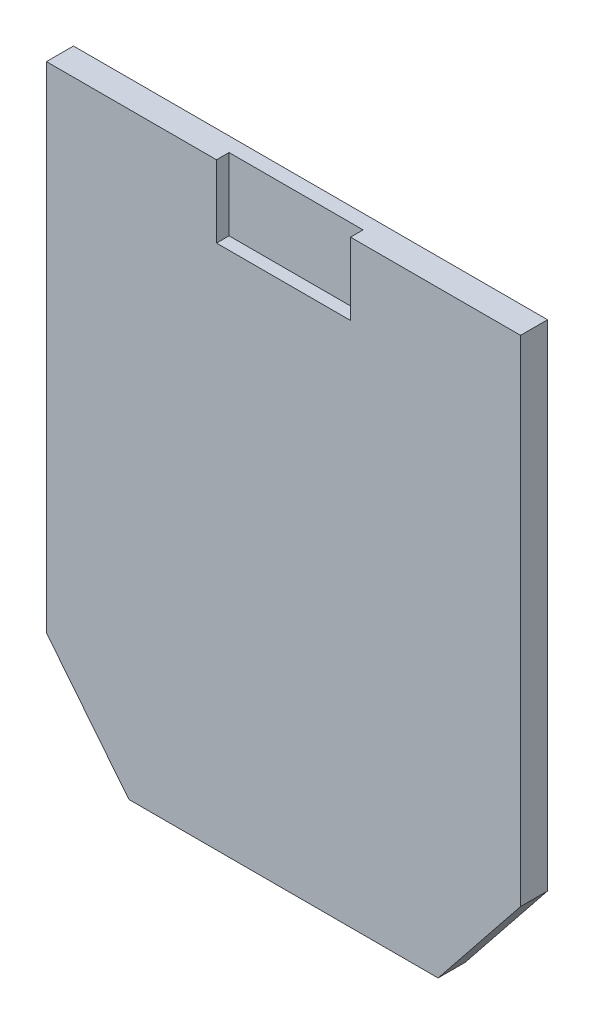
ISO-10303-21;
HEADER;
FILE_DESCRIPTION(('STEP AP214'),'2;1');
FILE_NAME('part.step','',(''),(''),'','','');
FILE_SCHEMA(('AUTOMOTIVE_DESIGN { 1 0 10303 214 1 1 1 1 }'));
ENDSEC;
DATA;
#1=APPLICATION_CONTEXT('core data for automotive mechanical design processes');
#2=APPLICATION_PROTOCOL_DEFINITION('international standard','automotive_design',2000,#1);
#3=PRODUCT_CONTEXT('',#1,'mechanical');
#4=PRODUCT('Part','Part','',(#3));
#5=PRODUCT_RELATED_PRODUCT_CATEGORY('part','',(#4));
#6=PRODUCT_DEFINITION_FORMATION('','',#4);
#7=PRODUCT_DEFINITION_CONTEXT('part definition',#1,'design');
#8=PRODUCT_DEFINITION('design','',#6,#7);
#9=PRODUCT_DEFINITION_SHAPE('','',#8);
#10=(LENGTH_UNIT() NAMED_UNIT(*) SI_UNIT(.MILLI.,.METRE.));
#11=(NAMED_UNIT(*) PLANE_ANGLE_UNIT() SI_UNIT($,.RADIAN.));
#12=(NAMED_UNIT(*) SI_UNIT($,.STERADIAN.) SOLID_ANGLE_UNIT());
#13=UNCERTAINTY_MEASURE_WITH_UNIT(LENGTH_MEASURE(1.E-05),#10,'distance_accuracy_value','');
#14=(GEOMETRIC_REPRESENTATION_CONTEXT(3) GLOBAL_UNCERTAINTY_ASSIGNED_CONTEXT((#13)) GLOBAL_UNIT_ASSIGNED_CONTEXT((#10,
#11,#12)) REPRESENTATION_CONTEXT('',''));
#15=CARTESIAN_POINT('',(0.,0.,0.));
#16=DIRECTION('',(0.,0.,1.));
#17=DIRECTION('',(1.,0.,0.));
#18=AXIS2_PLACEMENT_3D('',#15,#16,#17);
#19=CARTESIAN_POINT('',(-32.499999999986,120.,12.0000000000759));
#20=DIRECTION('',(-1.,0.,2.33402706883989E-12));
#21=DIRECTION('',(2.33402706883989E-12,0.,1.));
#22=AXIS2_PLACEMENT_3D('',#19,#20,#21);
#23=PLANE('',#22);
#24=DIRECTION('',(0.,-1.,0.));
#25=VECTOR('',#24,1.);
#26=CARTESIAN_POINT('',(-32.5000000000003,120.,5.90000000007587));
#27=LINE('',#26,#25);
#28=CARTESIAN_POINT('',(-32.5000000000003,120.,5.90000000007587));
#29=VERTEX_POINT('',#28);
#30=CARTESIAN_POINT('',(-32.5000000000003,85.,5.90000000007587));
#31=VERTEX_POINT('',#30);
#32=EDGE_CURVE('E60',#29,#31,#27,.T.);
#33=ORIENTED_EDGE('',*,*,#32,.F.);
#34=DIRECTION('',(-2.33402706883989E-12,0.,-1.));
#35=VECTOR('',#34,1.);
#36=CARTESIAN_POINT('',(-32.499999999986,120.,12.0000000000759));
#37=LINE('',#36,#35);
#38=CARTESIAN_POINT('',(-32.499999999986,120.,12.0000000000759));
#39=VERTEX_POINT('',#38);
#40=EDGE_CURVE('E133',#39,#29,#37,.T.);
#41=ORIENTED_EDGE('',*,*,#40,.F.);
#42=DIRECTION('',(0.,1.,0.));
#43=VECTOR('',#42,1.);
#44=CARTESIAN_POINT('',(-32.499999999986,120.,12.0000000000759));
#45=LINE('',#44,#43);
#46=CARTESIAN_POINT('',(-32.499999999986,85.,12.0000000000759));
#47=VERTEX_POINT('',#46);
#48=EDGE_CURVE('E151',#47,#39,#45,.T.);
#49=ORIENTED_EDGE('',*,*,#48,.F.);
#50=DIRECTION('',(-2.33402706883989E-12,0.,-1.));
#51=VECTOR('',#50,1.);
#52=CARTESIAN_POINT('',(-32.499999999986,85.,12.0000000000759));
#53=LINE('',#52,#51);
#54=EDGE_CURVE('E159',#47,#31,#53,.T.);
#55=ORIENTED_EDGE('',*,*,#54,.T.);
#56=EDGE_LOOP('',(#33,#41,#49,#55));
#57=FACE_BOUND('',#56,.T.);
#58=ADVANCED_FACE('F40',(#57),#23,.F.);
#59=CARTESIAN_POINT('',(32.500000000014,85.,11.9999999999242));
#60=DIRECTION('',(0.,-1.,0.));
#61=DIRECTION('',(2.33402706883989E-12,0.,1.));
#62=AXIS2_PLACEMENT_3D('',#59,#60,#61);
#63=PLANE('',#62);
#64=DIRECTION('',(1.,0.,-2.33402706883989E-12));
#65=VECTOR('',#64,1.);
#66=CARTESIAN_POINT('',(32.4999999999997,85.,5.89999999992416));
#67=LINE('',#66,#65);
#68=CARTESIAN_POINT('',(32.4999999999997,85.,5.89999999992416));
#69=VERTEX_POINT('',#68);
#70=EDGE_CURVE('E140',#31,#69,#67,.T.);
#71=ORIENTED_EDGE('',*,*,#70,.F.);
#72=ORIENTED_EDGE('',*,*,#54,.F.);
#73=DIRECTION('',(-1.,0.,2.33402706883989E-12));
#74=VECTOR('',#73,1.);
#75=CARTESIAN_POINT('',(32.500000000014,85.,11.9999999999242));
#76=LINE('',#75,#74);
#77=CARTESIAN_POINT('',(32.500000000014,85.,11.9999999999242));
#78=VERTEX_POINT('',#77);
#79=EDGE_CURVE('E112',#78,#47,#76,.T.);
#80=ORIENTED_EDGE('',*,*,#79,.F.);
#81=DIRECTION('',(-2.33402706883989E-12,0.,-1.));
#82=VECTOR('',#81,1.);
#83=CARTESIAN_POINT('',(32.500000000014,85.,11.9999999999242));
#84=LINE('',#83,#82);
#85=EDGE_CURVE('E132',#78,#69,#84,.T.);
#86=ORIENTED_EDGE('',*,*,#85,.T.);
#87=EDGE_LOOP('',(#71,#72,#80,#86));
#88=FACE_BOUND('',#87,.T.);
#89=ADVANCED_FACE('F260',(#88),#63,.F.);
#90=CARTESIAN_POINT('',(32.500000000014,120.,11.9999999999242));
#91=DIRECTION('',(1.,0.,-2.33402706883989E-12));
#92=DIRECTION('',(0.,-1.,0.));
#93=AXIS2_PLACEMENT_3D('',#90,#91,#92);
#94=PLANE('',#93);
#95=DIRECTION('',(0.,1.,0.));
#96=VECTOR('',#95,1.);
#97=CARTESIAN_POINT('',(32.4999999999998,120.,5.89999999992416));
#98=LINE('',#97,#96);
#99=CARTESIAN_POINT('',(32.4999999999998,120.,5.89999999992416));
#100=VERTEX_POINT('',#99);
#101=EDGE_CURVE('E11',#69,#100,#98,.T.);
#102=ORIENTED_EDGE('',*,*,#101,.F.);
#103=ORIENTED_EDGE('',*,*,#85,.F.);
#104=DIRECTION('',(0.,-1.,0.));
#105=VECTOR('',#104,1.);
#106=CARTESIAN_POINT('',(32.500000000014,120.,11.9999999999242));
#107=LINE('',#106,#105);
#108=CARTESIAN_POINT('',(32.500000000014,120.,11.9999999999242));
#109=VERTEX_POINT('',#108);
#110=EDGE_CURVE('E126',#109,#78,#107,.T.);
#111=ORIENTED_EDGE('',*,*,#110,.F.);
#112=DIRECTION('',(-2.33402706883989E-12,0.,-1.));
#113=VECTOR('',#112,1.);
#114=CARTESIAN_POINT('',(32.500000000014,120.,11.9999999999242));
#115=LINE('',#114,#113);
#116=EDGE_CURVE('E122',#109,#100,#115,.T.);
#117=ORIENTED_EDGE('',*,*,#116,.T.);
#118=EDGE_LOOP('',(#102,#103,#111,#117));
#119=FACE_BOUND('',#118,.T.);
#120=ADVANCED_FACE('F123',(#119),#94,.F.);
#121=CARTESIAN_POINT('',(114.999999999983,-120.,-1.1000000002684));
#122=DIRECTION('',(-1.,0.,2.33402706883989E-12));
#123=DIRECTION('',(2.33402706883989E-12,0.,1.));
#124=AXIS2_PLACEMENT_3D('',#121,#122,#123);
#125=PLANE('',#124);
#126=DIRECTION('',(0.,-1.,0.));
#127=VECTOR('',#126,1.);
#128=CARTESIAN_POINT('',(115.000000000014,-120.,11.9999999997316));
#129=LINE('',#128,#127);
#130=CARTESIAN_POINT('',(115.000000000014,120.,11.9999999997316));
#131=VERTEX_POINT('',#130);
#132=CARTESIAN_POINT('',(115.000000000014,-120.,11.9999999997316));
#133=VERTEX_POINT('',#132);
#134=EDGE_CURVE('E162',#131,#133,#129,.T.);
#135=ORIENTED_EDGE('',*,*,#134,.T.);
#136=DIRECTION('',(2.33402706883989E-12,0.,1.));
#137=VECTOR('',#136,1.);
#138=CARTESIAN_POINT('',(114.999999999983,-120.,-1.1000000002684));
#139=LINE('',#138,#137);
#140=CARTESIAN_POINT('',(114.999999999983,-120.,-1.1000000002684));
#141=VERTEX_POINT('',#140);
#142=EDGE_CURVE('E208',#141,#133,#139,.T.);
#143=ORIENTED_EDGE('',*,*,#142,.F.);
#144=DIRECTION('',(0.,-1.,0.));
#145=VECTOR('',#144,1.);
#146=CARTESIAN_POINT('',(114.999999999983,-120.,-1.1000000002684));
#147=LINE('',#146,#145);
#148=CARTESIAN_POINT('',(114.999999999983,120.,-1.1000000002684));
#149=VERTEX_POINT('',#148);
#150=EDGE_CURVE('E167',#149,#141,#147,.T.);
#151=ORIENTED_EDGE('',*,*,#150,.F.);
#152=DIRECTION('',(2.33402706883989E-12,0.,1.));
#153=VECTOR('',#152,1.);
#154=CARTESIAN_POINT('',(114.999999999983,120.,-1.1000000002684));
#155=LINE('',#154,#153);
#156=EDGE_CURVE('E212',#149,#131,#155,.T.);
#157=ORIENTED_EDGE('',*,*,#156,.T.);
#158=EDGE_LOOP('',(#135,#143,#151,#157));
#159=FACE_BOUND('',#158,.T.);
#160=ADVANCED_FACE('F42',(#159),#125,.F.);
#161=CARTESIAN_POINT('',(114.999999999983,-120.,-1.1000000002684));
#162=DIRECTION('',(-0.78086880944303,0.624695047554424,1.82256893845281E-12));
#163=DIRECTION('',(0.624695047554425,0.78086880944303,-1.45805515076225E-12));
#164=AXIS2_PLACEMENT_3D('',#161,#162,#163);
#165=PLANE('',#164);
#166=DIRECTION('',(-0.624695047554425,-0.78086880944303,1.45805515076225E-12));
#167=VECTOR('',#166,1.);
#168=CARTESIAN_POINT('',(115.000000000014,-120.,11.9999999997316));
#169=LINE('',#168,#167);
#170=CARTESIAN_POINT('',(75.000000000014,-170.,11.999999999825));
#171=VERTEX_POINT('',#170);
#172=EDGE_CURVE('E189',#133,#171,#169,.T.);
#173=ORIENTED_EDGE('',*,*,#172,.T.);
#174=DIRECTION('',(2.33402706883989E-12,0.,1.));
#175=VECTOR('',#174,1.);
#176=CARTESIAN_POINT('',(74.9999999999834,-170.,-1.10000000017504));
#177=LINE('',#176,#175);
#178=CARTESIAN_POINT('',(74.9999999999834,-170.,-1.10000000017504));
#179=VERTEX_POINT('',#178);
#180=EDGE_CURVE('E44',#179,#171,#177,.T.);
#181=ORIENTED_EDGE('',*,*,#180,.F.);
#182=DIRECTION('',(-0.624695047554425,-0.78086880944303,1.45805515076225E-12));
#183=VECTOR('',#182,1.);
#184=CARTESIAN_POINT('',(114.999999999983,-120.,-1.1000000002684));
#185=LINE('',#184,#183);
#186=EDGE_CURVE('E170',#141,#179,#185,.T.);
#187=ORIENTED_EDGE('',*,*,#186,.F.);
#188=ORIENTED_EDGE('',*,*,#142,.T.);
#189=EDGE_LOOP('',(#173,#181,#187,#188));
#190=FACE_BOUND('',#189,.T.);
#191=ADVANCED_FACE('F235',(#190),#165,.F.);
#192=CARTESIAN_POINT('',(-75.0000000000166,-170.,-1.09999999982493));
#193=DIRECTION('',(0.,1.,0.));
#194=DIRECTION('',(1.,0.,-2.33402706883989E-12));
#195=AXIS2_PLACEMENT_3D('',#192,#193,#194);
#196=PLANE('',#195);
#197=DIRECTION('',(-1.,0.,2.33402706883989E-12));
#198=VECTOR('',#197,1.);
#199=CARTESIAN_POINT('',(-74.999999999986,-170.,12.0000000001751));
#200=LINE('',#199,#198);
#201=CARTESIAN_POINT('',(-74.999999999986,-170.,12.0000000001751));
#202=VERTEX_POINT('',#201);
#203=EDGE_CURVE('E193',#171,#202,#200,.T.);
#204=ORIENTED_EDGE('',*,*,#203,.T.);
#205=DIRECTION('',(2.33402706883989E-12,0.,1.));
#206=VECTOR('',#205,1.);
#207=CARTESIAN_POINT('',(-75.0000000000166,-170.,-1.09999999982493));
#208=LINE('',#207,#206);
#209=CARTESIAN_POINT('',(-75.0000000000166,-170.,-1.09999999982493));
#210=VERTEX_POINT('',#209);
#211=EDGE_CURVE('E185',#210,#202,#208,.T.);
#212=ORIENTED_EDGE('',*,*,#211,.F.);
#213=DIRECTION('',(-1.,0.,2.33402706883989E-12));
#214=VECTOR('',#213,1.);
#215=CARTESIAN_POINT('',(-75.0000000000166,-170.,-1.09999999982493));
#216=LINE('',#215,#214);
#217=EDGE_CURVE('E174',#179,#210,#216,.T.);
#218=ORIENTED_EDGE('',*,*,#217,.F.);
#219=ORIENTED_EDGE('',*,*,#180,.T.);
#220=EDGE_LOOP('',(#204,#212,#218,#219));
#221=FACE_BOUND('',#220,.T.);
#222=ADVANCED_FACE('F232',(#221),#196,.F.);
#223=CARTESIAN_POINT('',(-115.000000000017,-120.,-1.09999999973157));
#224=DIRECTION('',(0.78086880944303,0.624695047554424,-1.82256893845281E-12));
#225=DIRECTION('',(0.624695047554425,-0.78086880944303,-1.45805515076225E-12));
#226=AXIS2_PLACEMENT_3D('',#223,#224,#225);
#227=PLANE('',#226);
#228=DIRECTION('',(-0.624695047554425,0.78086880944303,1.45805515076225E-12));
#229=VECTOR('',#228,1.);
#230=CARTESIAN_POINT('',(-115.000000000017,-120.,-1.09999999973157));
#231=LINE('',#230,#229);
#232=CARTESIAN_POINT('',(-115.000000000017,-120.,-1.09999999973157));
#233=VERTEX_POINT('',#232);
#234=EDGE_CURVE('E177',#210,#233,#231,.T.);
#235=ORIENTED_EDGE('',*,*,#234,.F.);
#236=ORIENTED_EDGE('',*,*,#211,.T.);
#237=DIRECTION('',(-0.624695047554425,0.78086880944303,1.45805515076225E-12));
#238=VECTOR('',#237,1.);
#239=CARTESIAN_POINT('',(-114.999999999986,-120.,12.0000000002684));
#240=LINE('',#239,#238);
#241=CARTESIAN_POINT('',(-114.999999999986,-120.,12.0000000002684));
#242=VERTEX_POINT('',#241);
#243=EDGE_CURVE('E197',#202,#242,#240,.T.);
#244=ORIENTED_EDGE('',*,*,#243,.T.);
#245=DIRECTION('',(2.33402706883989E-12,0.,1.));
#246=VECTOR('',#245,1.);
#247=CARTESIAN_POINT('',(-115.000000000017,-120.,-1.09999999973157));
#248=LINE('',#247,#246);
#249=EDGE_CURVE('E216',#233,#242,#248,.T.);
#250=ORIENTED_EDGE('',*,*,#249,.F.);
#251=EDGE_LOOP('',(#235,#236,#244,#250));
#252=FACE_BOUND('',#251,.T.);
#253=ADVANCED_FACE('F240',(#252),#227,.F.);
#254=CARTESIAN_POINT('',(-115.000000000017,-120.,-1.09999999973157));
#255=DIRECTION('',(1.,0.,-2.33402706883989E-12));
#256=DIRECTION('',(-2.33402706883989E-12,0.,-1.));
#257=AXIS2_PLACEMENT_3D('',#254,#255,#256);
#258=PLANE('',#257);
#259=DIRECTION('',(0.,1.,0.));
#260=VECTOR('',#259,1.);
#261=CARTESIAN_POINT('',(-115.000000000017,-120.,-1.09999999973157));
#262=LINE('',#261,#260);
#263=CARTESIAN_POINT('',(-115.000000000017,120.,-1.09999999973157));
#264=VERTEX_POINT('',#263);
#265=EDGE_CURVE('E103',#233,#264,#262,.T.);
#266=ORIENTED_EDGE('',*,*,#265,.F.);
#267=ORIENTED_EDGE('',*,*,#249,.T.);
#268=DIRECTION('',(0.,1.,0.));
#269=VECTOR('',#268,1.);
#270=CARTESIAN_POINT('',(-114.999999999986,-120.,12.0000000002684));
#271=LINE('',#270,#269);
#272=CARTESIAN_POINT('',(-114.999999999986,120.,12.0000000002684));
#273=VERTEX_POINT('',#272);
#274=EDGE_CURVE('E201',#242,#273,#271,.T.);
#275=ORIENTED_EDGE('',*,*,#274,.T.);
#276=DIRECTION('',(2.33402706883989E-12,0.,1.));
#277=VECTOR('',#276,1.);
#278=CARTESIAN_POINT('',(-115.000000000017,120.,-1.09999999973157));
#279=LINE('',#278,#277);
#280=EDGE_CURVE('E51',#264,#273,#279,.T.);
#281=ORIENTED_EDGE('',*,*,#280,.F.);
#282=EDGE_LOOP('',(#266,#267,#275,#281));
#283=FACE_BOUND('',#282,.T.);
#284=ADVANCED_FACE('F242',(#283),#258,.F.);
#285=CARTESIAN_POINT('',(-115.000000000017,120.,-1.09999999973157));
#286=DIRECTION('',(0.,-1.,0.));
#287=DIRECTION('',(-1.,0.,2.33402706883989E-12));
#288=AXIS2_PLACEMENT_3D('',#285,#286,#287);
#289=PLANE('',#288);
#290=ORIENTED_EDGE('',*,*,#156,.F.);
#291=DIRECTION('',(1.,0.,-2.33402706883989E-12));
#292=VECTOR('',#291,1.);
#293=CARTESIAN_POINT('',(-115.000000000017,120.,-1.09999999973157));
#294=LINE('',#293,#292);
#295=EDGE_CURVE('E182',#264,#149,#294,.T.);
#296=ORIENTED_EDGE('',*,*,#295,.F.);
#297=ORIENTED_EDGE('',*,*,#280,.T.);
#298=DIRECTION('',(1.,0.,-2.33402706883989E-12));
#299=VECTOR('',#298,1.);
#300=CARTESIAN_POINT('',(-114.999999999986,120.,12.0000000002684));
#301=LINE('',#300,#299);
#302=EDGE_CURVE('E171',#273,#39,#301,.T.);
#303=ORIENTED_EDGE('',*,*,#302,.T.);
#304=ORIENTED_EDGE('',*,*,#40,.T.);
#305=DIRECTION('',(1.,0.,-2.33402706883989E-12));
#306=VECTOR('',#305,1.);
#307=CARTESIAN_POINT('',(52.1785918927274,120.,5.89999999987823));
#308=LINE('',#307,#306);
#309=EDGE_CURVE('E139',#29,#100,#308,.T.);
#310=ORIENTED_EDGE('',*,*,#309,.T.);
#311=ORIENTED_EDGE('',*,*,#116,.F.);
#312=EDGE_CURVE('E205',#109,#131,#301,.T.);
#313=ORIENTED_EDGE('',*,*,#312,.T.);
#314=EDGE_LOOP('',(#290,#296,#297,#303,#304,#310,#311,#313));
#315=FACE_BOUND('',#314,.T.);
#316=ADVANCED_FACE('F142',(#315),#289,.F.);
#317=CARTESIAN_POINT('',(-1.65956248851691E-11,0.,-1.09999999999998));
#318=DIRECTION('',(-2.33402706883989E-12,0.,-1.));
#319=DIRECTION('',(-1.,0.,2.33402706883989E-12));
#320=AXIS2_PLACEMENT_3D('',#317,#318,#319);
#321=PLANE('',#320);
#322=ORIENTED_EDGE('',*,*,#295,.T.);
#323=ORIENTED_EDGE('',*,*,#150,.T.);
#324=ORIENTED_EDGE('',*,*,#186,.T.);
#325=ORIENTED_EDGE('',*,*,#217,.T.);
#326=ORIENTED_EDGE('',*,*,#234,.T.);
#327=ORIENTED_EDGE('',*,*,#265,.T.);
#328=EDGE_LOOP('',(#322,#323,#324,#325,#326,#327));
#329=FACE_BOUND('',#328,.T.);
#330=ADVANCED_FACE('F245',(#329),#321,.T.);
#331=CARTESIAN_POINT('',(1.39801297166335E-11,0.,12.));
#332=DIRECTION('',(-2.33402706883989E-12,0.,-1.));
#333=DIRECTION('',(-1.,0.,2.33402706883989E-12));
#334=AXIS2_PLACEMENT_3D('',#331,#332,#333);
#335=PLANE('',#334);
#336=ORIENTED_EDGE('',*,*,#79,.T.);
#337=ORIENTED_EDGE('',*,*,#48,.T.);
#338=ORIENTED_EDGE('',*,*,#302,.F.);
#339=ORIENTED_EDGE('',*,*,#274,.F.);
#340=ORIENTED_EDGE('',*,*,#243,.F.);
#341=ORIENTED_EDGE('',*,*,#203,.F.);
#342=ORIENTED_EDGE('',*,*,#172,.F.);
#343=ORIENTED_EDGE('',*,*,#134,.F.);
#344=ORIENTED_EDGE('',*,*,#312,.F.);
#345=ORIENTED_EDGE('',*,*,#110,.T.);
#346=EDGE_LOOP('',(#336,#337,#338,#339,#340,#341,#342,#343,#344,#345));
#347=FACE_BOUND('',#346,.T.);
#348=ADVANCED_FACE('F238',(#347),#335,.F.);
#349=CARTESIAN_POINT('',(-2.57435403289851E-13,0.,5.90000000000001));
#350=DIRECTION('',(-2.33402706883989E-12,0.,-1.));
#351=DIRECTION('',(-1.,0.,2.33402706883989E-12));
#352=AXIS2_PLACEMENT_3D('',#349,#350,#351);
#353=PLANE('',#352);
#354=ORIENTED_EDGE('',*,*,#309,.F.);
#355=ORIENTED_EDGE('',*,*,#32,.T.);
#356=ORIENTED_EDGE('',*,*,#70,.T.);
#357=ORIENTED_EDGE('',*,*,#101,.T.);
#358=EDGE_LOOP('',(#354,#355,#356,#357));
#359=FACE_BOUND('',#358,.T.);
#360=ADVANCED_FACE('F138',(#359),#353,.F.);
#361=CLOSED_SHELL('',(#58,#89,#120,#160,#191,#222,#253,#284,#316,#330,#348,#360));
#362=MANIFOLD_SOLID_BREP('B2',#361);
#363=ADVANCED_BREP_SHAPE_REPRESENTATION('',(#18,#362),#14);
#364=SHAPE_DEFINITION_REPRESENTATION(#9,#363);
ENDSEC;
END-ISO-10303-21;
